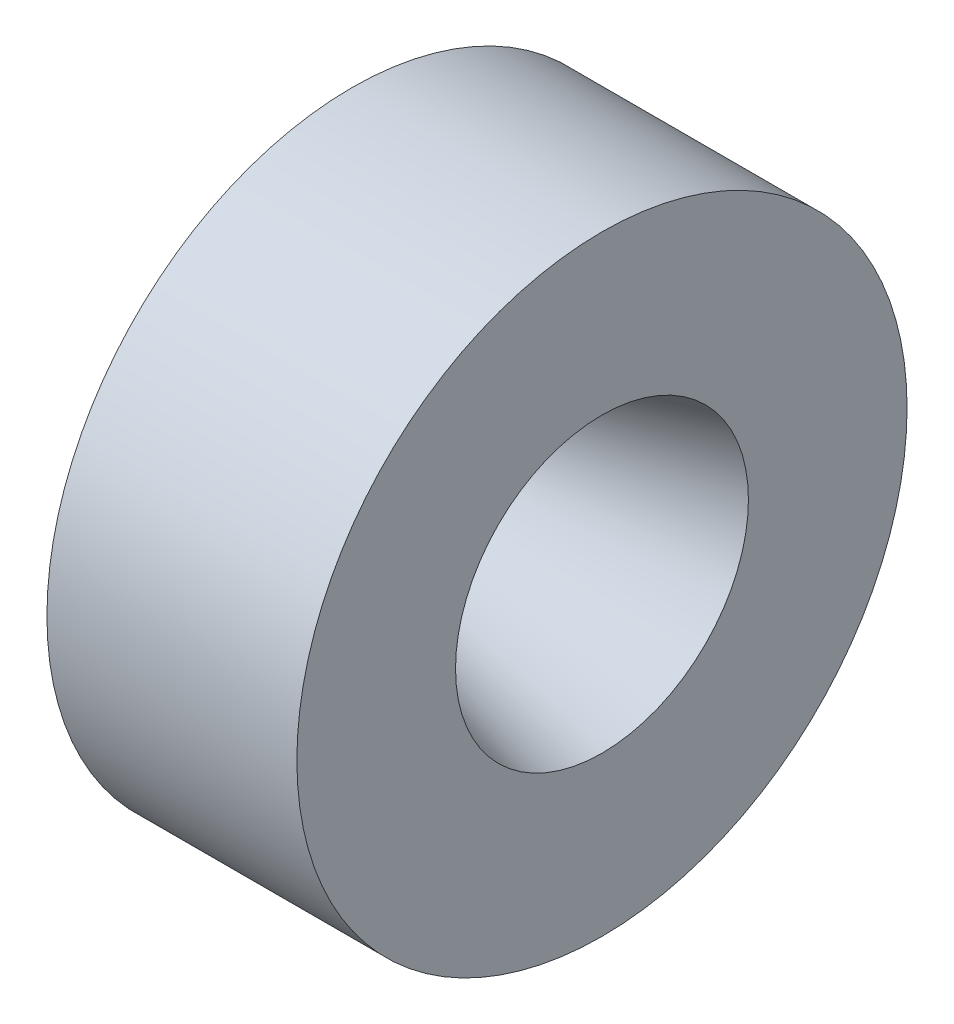
ISO-10303-21;
HEADER;
FILE_DESCRIPTION(('STEP AP214'),'2;1');
FILE_NAME('part.step','',(''),(''),'','','');
FILE_SCHEMA(('AUTOMOTIVE_DESIGN { 1 0 10303 214 1 1 1 1 }'));
ENDSEC;
DATA;
#1=APPLICATION_CONTEXT('core data for automotive mechanical design processes');
#2=APPLICATION_PROTOCOL_DEFINITION('international standard','automotive_design',2000,#1);
#3=PRODUCT_CONTEXT('',#1,'mechanical');
#4=PRODUCT('Part','Part','',(#3));
#5=PRODUCT_RELATED_PRODUCT_CATEGORY('part','',(#4));
#6=PRODUCT_DEFINITION_FORMATION('','',#4);
#7=PRODUCT_DEFINITION_CONTEXT('part definition',#1,'design');
#8=PRODUCT_DEFINITION('design','',#6,#7);
#9=PRODUCT_DEFINITION_SHAPE('','',#8);
#10=(LENGTH_UNIT() NAMED_UNIT(*) SI_UNIT(.MILLI.,.METRE.));
#11=(NAMED_UNIT(*) PLANE_ANGLE_UNIT() SI_UNIT($,.RADIAN.));
#12=(NAMED_UNIT(*) SI_UNIT($,.STERADIAN.) SOLID_ANGLE_UNIT());
#13=UNCERTAINTY_MEASURE_WITH_UNIT(LENGTH_MEASURE(1.E-05),#10,'distance_accuracy_value','');
#14=(GEOMETRIC_REPRESENTATION_CONTEXT(3) GLOBAL_UNCERTAINTY_ASSIGNED_CONTEXT((#13)) GLOBAL_UNIT_ASSIGNED_CONTEXT((#10,
#11,#12)) REPRESENTATION_CONTEXT('',''));
#15=CARTESIAN_POINT('',(0.,0.,0.));
#16=DIRECTION('',(0.,0.,1.));
#17=DIRECTION('',(1.,0.,0.));
#18=AXIS2_PLACEMENT_3D('',#15,#16,#17);
#19=CARTESIAN_POINT('',(154.0002,0.,0.));
#20=DIRECTION('',(1.,0.,0.));
#21=DIRECTION('',(0.,0.,-1.));
#22=AXIS2_PLACEMENT_3D('',#19,#20,#21);
#23=CYLINDRICAL_SURFACE('',#22,53.975);
#24=CARTESIAN_POINT('',(155.6004,0.,0.));
#25=DIRECTION('',(1.,0.,0.));
#26=DIRECTION('',(0.,0.,-1.));
#27=AXIS2_PLACEMENT_3D('',#24,#25,#26);
#28=CIRCLE('',#27,53.975);
#29=CARTESIAN_POINT('',(155.6004,0.,-53.975));
#30=VERTEX_POINT('',#29);
#31=EDGE_CURVE('E60',#30,#30,#28,.T.);
#32=ORIENTED_EDGE('',*,*,#31,.T.);
#33=EDGE_LOOP('',(#32));
#34=FACE_BOUND('',#33,.T.);
#35=CARTESIAN_POINT('',(199.817260732384,0.,0.));
#36=DIRECTION('',(1.,0.,0.));
#37=DIRECTION('',(0.,0.,-1.));
#38=AXIS2_PLACEMENT_3D('',#35,#36,#37);
#39=CIRCLE('',#38,53.975);
#40=CARTESIAN_POINT('',(199.817260732384,0.,-53.975));
#41=VERTEX_POINT('',#40);
#42=EDGE_CURVE('E72',#41,#41,#39,.T.);
#43=ORIENTED_EDGE('',*,*,#42,.F.);
#44=EDGE_LOOP('',(#43));
#45=FACE_BOUND('',#44,.T.);
#46=ADVANCED_FACE('F34',(#34,#45),#23,.T.);
#47=CARTESIAN_POINT('',(155.6004,53.975,0.));
#48=DIRECTION('',(-1.,0.,0.));
#49=DIRECTION('',(0.,0.,1.));
#50=AXIS2_PLACEMENT_3D('',#47,#48,#49);
#51=PLANE('',#50);
#52=CARTESIAN_POINT('',(155.6004,0.,0.));
#53=DIRECTION('',(-1.,0.,0.));
#54=DIRECTION('',(0.,0.,1.));
#55=AXIS2_PLACEMENT_3D('',#52,#53,#54);
#56=CIRCLE('',#55,44.069);
#57=CARTESIAN_POINT('',(155.6004,0.,44.069));
#58=VERTEX_POINT('',#57);
#59=EDGE_CURVE('E49',#58,#58,#56,.F.);
#60=ORIENTED_EDGE('',*,*,#59,.T.);
#61=EDGE_LOOP('',(#60));
#62=FACE_BOUND('',#61,.T.);
#63=ORIENTED_EDGE('',*,*,#31,.F.);
#64=EDGE_LOOP('',(#63));
#65=FACE_BOUND('',#64,.T.);
#66=ADVANCED_FACE('F80',(#62,#65),#51,.T.);
#67=CARTESIAN_POINT('',(154.0002,0.,0.));
#68=DIRECTION('',(1.,0.,0.));
#69=DIRECTION('',(0.,0.,-1.));
#70=AXIS2_PLACEMENT_3D('',#67,#68,#69);
#71=CYLINDRICAL_SURFACE('',#70,43.815);
#72=CARTESIAN_POINT('',(155.3464,0.,0.));
#73=DIRECTION('',(-1.,0.,0.));
#74=DIRECTION('',(0.,0.,1.));
#75=AXIS2_PLACEMENT_3D('',#72,#73,#74);
#76=CIRCLE('',#75,43.815);
#77=CARTESIAN_POINT('',(155.3464,0.,43.815));
#78=VERTEX_POINT('',#77);
#79=EDGE_CURVE('E45',#78,#78,#76,.T.);
#80=ORIENTED_EDGE('',*,*,#79,.T.);
#81=EDGE_LOOP('',(#80));
#82=FACE_BOUND('',#81,.T.);
#83=CARTESIAN_POINT('',(153.0604,0.,0.));
#84=DIRECTION('',(1.,0.,0.));
#85=DIRECTION('',(0.,0.,-1.));
#86=AXIS2_PLACEMENT_3D('',#83,#84,#85);
#87=CIRCLE('',#86,43.815);
#88=CARTESIAN_POINT('',(153.0604,0.,-43.815));
#89=VERTEX_POINT('',#88);
#90=EDGE_CURVE('E63',#89,#89,#87,.T.);
#91=ORIENTED_EDGE('',*,*,#90,.T.);
#92=EDGE_LOOP('',(#91));
#93=FACE_BOUND('',#92,.T.);
#94=ADVANCED_FACE('F86',(#82,#93),#71,.T.);
#95=CARTESIAN_POINT('',(153.0604,43.815,0.));
#96=DIRECTION('',(-1.,0.,0.));
#97=DIRECTION('',(0.,0.,1.));
#98=AXIS2_PLACEMENT_3D('',#95,#96,#97);
#99=PLANE('',#98);
#100=CARTESIAN_POINT('',(153.0604,0.,0.));
#101=DIRECTION('',(1.,0.,0.));
#102=DIRECTION('',(0.,0.,-1.));
#103=AXIS2_PLACEMENT_3D('',#100,#101,#102);
#104=CIRCLE('',#103,40.005);
#105=CARTESIAN_POINT('',(153.0604,0.,-40.005));
#106=VERTEX_POINT('',#105);
#107=EDGE_CURVE('E66',#106,#106,#104,.T.);
#108=ORIENTED_EDGE('',*,*,#107,.T.);
#109=EDGE_LOOP('',(#108));
#110=FACE_BOUND('',#109,.T.);
#111=ORIENTED_EDGE('',*,*,#90,.F.);
#112=EDGE_LOOP('',(#111));
#113=FACE_BOUND('',#112,.T.);
#114=ADVANCED_FACE('F109',(#110,#113),#99,.T.);
#115=CARTESIAN_POINT('',(154.0002,0.,0.));
#116=DIRECTION('',(1.,0.,0.));
#117=DIRECTION('',(0.,0.,-1.));
#118=AXIS2_PLACEMENT_3D('',#115,#116,#117);
#119=CYLINDRICAL_SURFACE('',#118,40.005);
#120=CARTESIAN_POINT('',(155.438584153755,0.,0.));
#121=DIRECTION('',(1.,0.,0.));
#122=DIRECTION('',(0.,0.,-1.));
#123=AXIS2_PLACEMENT_3D('',#120,#121,#122);
#124=CIRCLE('',#123,40.005);
#125=CARTESIAN_POINT('',(155.438584153755,0.,-40.005));
#126=VERTEX_POINT('',#125);
#127=EDGE_CURVE('E57',#126,#126,#124,.T.);
#128=ORIENTED_EDGE('',*,*,#127,.T.);
#129=EDGE_LOOP('',(#128));
#130=FACE_BOUND('',#129,.T.);
#131=ORIENTED_EDGE('',*,*,#107,.F.);
#132=EDGE_LOOP('',(#131));
#133=FACE_BOUND('',#132,.T.);
#134=ADVANCED_FACE('F113',(#130,#133),#119,.F.);
#135=CARTESIAN_POINT('',(155.6004,0.,0.));
#136=DIRECTION('',(-1.,0.,0.));
#137=DIRECTION('',(0.,0.,1.));
#138=AXIS2_PLACEMENT_3D('',#135,#136,#137);
#139=CONICAL_SURFACE('',#138,40.005,1.13446401379632);
#140=CARTESIAN_POINT('',(166.129763826063,0.,0.));
#141=DIRECTION('',(1.,0.,0.));
#142=DIRECTION('',(0.,0.,-1.));
#143=AXIS2_PLACEMENT_3D('',#140,#141,#142);
#144=CIRCLE('',#143,17.4247064064456);
#145=CARTESIAN_POINT('',(166.129763826063,0.,-17.4247064064456));
#146=VERTEX_POINT('',#145);
#147=EDGE_CURVE('E41',#146,#146,#144,.T.);
#148=ORIENTED_EDGE('',*,*,#147,.T.);
#149=EDGE_LOOP('',(#148));
#150=FACE_BOUND('',#149,.T.);
#151=CARTESIAN_POINT('',(155.668786331662,0.,0.));
#152=DIRECTION('',(-1.,0.,0.));
#153=DIRECTION('',(0.,0.,1.));
#154=AXIS2_PLACEMENT_3D('',#151,#152,#153);
#155=CIRCLE('',#154,39.8583450384821);
#156=CARTESIAN_POINT('',(155.668786331662,0.,39.8583450384821));
#157=VERTEX_POINT('',#156);
#158=EDGE_CURVE('E54',#157,#157,#155,.T.);
#159=ORIENTED_EDGE('',*,*,#158,.T.);
#160=EDGE_LOOP('',(#159));
#161=FACE_BOUND('',#160,.T.);
#162=ADVANCED_FACE('F119',(#150,#161),#139,.F.);
#163=CARTESIAN_POINT('',(166.35494678156,0.,0.));
#164=DIRECTION('',(1.,0.,0.));
#165=DIRECTION('',(0.,0.,-1.));
#166=AXIS2_PLACEMENT_3D('',#163,#164,#165);
#167=CONICAL_SURFACE('',#166,16.9418,0.26179938779915);
#168=CARTESIAN_POINT('',(166.869619364471,0.,0.));
#169=DIRECTION('',(-1.,0.,0.));
#170=DIRECTION('',(0.,0.,1.));
#171=AXIS2_PLACEMENT_3D('',#168,#169,#170);
#172=CIRCLE('',#171,17.0797061029574);
#173=CARTESIAN_POINT('',(166.869619364471,0.,17.0797061029574));
#174=VERTEX_POINT('',#173);
#175=EDGE_CURVE('E10',#174,#174,#172,.T.);
#176=ORIENTED_EDGE('',*,*,#175,.T.);
#177=EDGE_LOOP('',(#176));
#178=FACE_BOUND('',#177,.T.);
#179=CARTESIAN_POINT('',(199.817260732384,0.,0.));
#180=DIRECTION('',(1.,0.,0.));
#181=DIRECTION('',(0.,0.,-1.));
#182=AXIS2_PLACEMENT_3D('',#179,#180,#181);
#183=CIRCLE('',#182,25.908);
#184=CARTESIAN_POINT('',(199.817260732384,0.,-25.908));
#185=VERTEX_POINT('',#184);
#186=EDGE_CURVE('E69',#185,#185,#183,.T.);
#187=ORIENTED_EDGE('',*,*,#186,.T.);
#188=EDGE_LOOP('',(#187));
#189=FACE_BOUND('',#188,.T.);
#190=ADVANCED_FACE('F125',(#178,#189),#167,.F.);
#191=CARTESIAN_POINT('',(199.817260732384,25.908,0.));
#192=DIRECTION('',(1.,0.,0.));
#193=DIRECTION('',(0.,0.,-1.));
#194=AXIS2_PLACEMENT_3D('',#191,#192,#193);
#195=PLANE('',#194);
#196=ORIENTED_EDGE('',*,*,#42,.T.);
#197=EDGE_LOOP('',(#196));
#198=FACE_BOUND('',#197,.T.);
#199=ORIENTED_EDGE('',*,*,#186,.F.);
#200=EDGE_LOOP('',(#199));
#201=FACE_BOUND('',#200,.T.);
#202=ADVANCED_FACE('F76',(#198,#201),#195,.T.);
#203=CARTESIAN_POINT('',(155.438584153755,0.,0.));
#204=DIRECTION('',(1.,0.,0.));
#205=DIRECTION('',(0.,0.,-1.));
#206=AXIS2_PLACEMENT_3D('',#203,#204,#205);
#207=TOROIDAL_SURFACE('',#206,39.751,0.254);
#208=ORIENTED_EDGE('',*,*,#158,.F.);
#209=EDGE_LOOP('',(#208));
#210=FACE_BOUND('',#209,.T.);
#211=ORIENTED_EDGE('',*,*,#127,.F.);
#212=EDGE_LOOP('',(#211));
#213=FACE_BOUND('',#212,.T.);
#214=ADVANCED_FACE('F91',(#210,#213),#207,.F.);
#215=CARTESIAN_POINT('',(155.3464,0.,0.));
#216=DIRECTION('',(-1.,0.,0.));
#217=DIRECTION('',(0.,0.,1.));
#218=AXIS2_PLACEMENT_3D('',#215,#216,#217);
#219=TOROIDAL_SURFACE('',#218,44.069,0.254);
#220=ORIENTED_EDGE('',*,*,#79,.F.);
#221=EDGE_LOOP('',(#220));
#222=FACE_BOUND('',#221,.T.);
#223=ORIENTED_EDGE('',*,*,#59,.F.);
#224=EDGE_LOOP('',(#223));
#225=FACE_BOUND('',#224,.T.);
#226=ADVANCED_FACE('F93',(#222,#225),#219,.F.);
#227=CARTESIAN_POINT('',(166.705269270831,0.,0.));
#228=DIRECTION('',(-1.,0.,0.));
#229=DIRECTION('',(0.,0.,1.));
#230=AXIS2_PLACEMENT_3D('',#227,#228,#229);
#231=TOROIDAL_SURFACE('',#230,17.6930690026509,0.635);
#232=ORIENTED_EDGE('',*,*,#175,.F.);
#233=EDGE_LOOP('',(#232));
#234=FACE_BOUND('',#233,.T.);
#235=ORIENTED_EDGE('',*,*,#147,.F.);
#236=EDGE_LOOP('',(#235));
#237=FACE_BOUND('',#236,.T.);
#238=ADVANCED_FACE('F36',(#234,#237),#231,.T.);
#239=CLOSED_SHELL('',(#46,#66,#94,#114,#134,#162,#190,#202,#214,#226,#238));
#240=MANIFOLD_SOLID_BREP('B2',#239);
#241=ADVANCED_BREP_SHAPE_REPRESENTATION('',(#18,#240),#14);
#242=SHAPE_DEFINITION_REPRESENTATION(#9,#241);
ENDSEC;
END-ISO-10303-21;
